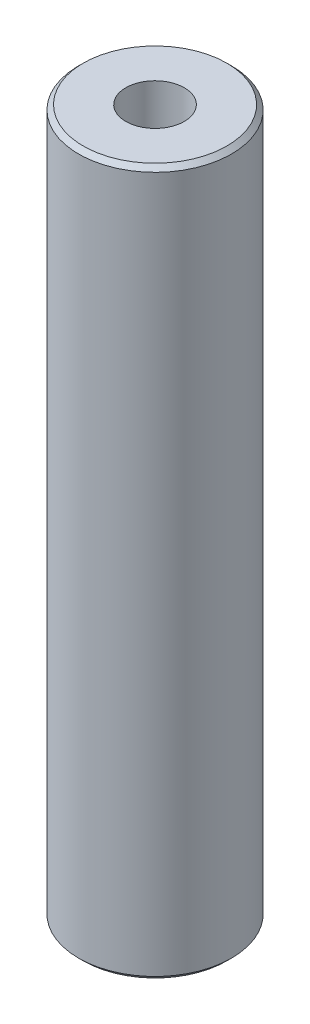
ISO-10303-21;
HEADER;
FILE_DESCRIPTION(('STEP AP214'),'2;1');
FILE_NAME('part.step','',(''),(''),'','','');
FILE_SCHEMA(('AUTOMOTIVE_DESIGN { 1 0 10303 214 1 1 1 1 }'));
ENDSEC;
DATA;
#1=APPLICATION_CONTEXT('core data for automotive mechanical design processes');
#2=APPLICATION_PROTOCOL_DEFINITION('international standard','automotive_design',2000,#1);
#3=PRODUCT_CONTEXT('',#1,'mechanical');
#4=PRODUCT('Part','Part','',(#3));
#5=PRODUCT_RELATED_PRODUCT_CATEGORY('part','',(#4));
#6=PRODUCT_DEFINITION_FORMATION('','',#4);
#7=PRODUCT_DEFINITION_CONTEXT('part definition',#1,'design');
#8=PRODUCT_DEFINITION('design','',#6,#7);
#9=PRODUCT_DEFINITION_SHAPE('','',#8);
#10=(LENGTH_UNIT() NAMED_UNIT(*) SI_UNIT(.MILLI.,.METRE.));
#11=(NAMED_UNIT(*) PLANE_ANGLE_UNIT() SI_UNIT($,.RADIAN.));
#12=(NAMED_UNIT(*) SI_UNIT($,.STERADIAN.) SOLID_ANGLE_UNIT());
#13=UNCERTAINTY_MEASURE_WITH_UNIT(LENGTH_MEASURE(1.E-05),#10,'distance_accuracy_value','');
#14=(GEOMETRIC_REPRESENTATION_CONTEXT(3) GLOBAL_UNCERTAINTY_ASSIGNED_CONTEXT((#13)) GLOBAL_UNIT_ASSIGNED_CONTEXT((#10,
#11,#12)) REPRESENTATION_CONTEXT('',''));
#15=CARTESIAN_POINT('',(0.,0.,0.));
#16=DIRECTION('',(0.,0.,1.));
#17=DIRECTION('',(1.,0.,0.));
#18=AXIS2_PLACEMENT_3D('',#15,#16,#17);
#19=CARTESIAN_POINT('',(0.,369.199846225601,0.));
#20=DIRECTION('',(0.,-1.,0.));
#21=DIRECTION('',(0.,0.,-1.));
#22=AXIS2_PLACEMENT_3D('',#19,#20,#21);
#23=CYLINDRICAL_SURFACE('',#22,40.);
#24=CARTESIAN_POINT('',(0.,366.779272620218,0.));
#25=DIRECTION('',(0.,1.,0.));
#26=DIRECTION('',(0.,0.,1.));
#27=AXIS2_PLACEMENT_3D('',#24,#25,#26);
#28=CIRCLE('',#27,40.);
#29=CARTESIAN_POINT('',(0.,366.779272620218,-40.));
#30=VERTEX_POINT('',#29);
#31=EDGE_CURVE('E50',#30,#30,#28,.F.);
#32=CARTESIAN_POINT('',(0.,2.42057360538284,0.));
#33=DIRECTION('',(0.,1.,0.));
#34=DIRECTION('',(0.,0.,1.));
#35=AXIS2_PLACEMENT_3D('',#32,#33,#34);
#36=CIRCLE('',#35,40.);
#37=CARTESIAN_POINT('',(0.,2.42057360538284,-40.));
#38=VERTEX_POINT('',#37);
#39=EDGE_CURVE('E51',#38,#38,#36,.T.);
#40=CARTESIAN_POINT('',(0.,366.779272620218,-40.));
#41=CARTESIAN_POINT('',(0.,362.98386950548,-40.));
#42=CARTESIAN_POINT('',(0.,359.188466390742,-40.));
#43=CARTESIAN_POINT('',(0.,351.597660161266,-40.));
#44=CARTESIAN_POINT('',(0.,347.802257046528,-40.));
#45=CARTESIAN_POINT('',(0.,340.211450817053,-40.));
#46=CARTESIAN_POINT('',(0.,336.416047702315,-40.));
#47=CARTESIAN_POINT('',(0.,328.825241472839,-40.));
#48=CARTESIAN_POINT('',(0.,325.029838358101,-40.));
#49=CARTESIAN_POINT('',(0.,317.439032128626,-40.));
#50=CARTESIAN_POINT('',(0.,313.643629013888,-40.));
#51=CARTESIAN_POINT('',(0.,306.052822784412,-40.));
#52=CARTESIAN_POINT('',(0.,302.257419669674,-40.));
#53=CARTESIAN_POINT('',(0.,294.666613440198,-40.));
#54=CARTESIAN_POINT('',(0.,290.87121032546,-40.));
#55=CARTESIAN_POINT('',(0.,283.280404095985,-40.));
#56=CARTESIAN_POINT('',(0.,279.485000981247,-40.));
#57=CARTESIAN_POINT('',(0.,271.894194751771,-40.));
#58=CARTESIAN_POINT('',(0.,268.098791637033,-40.));
#59=CARTESIAN_POINT('',(0.,260.507985407558,-40.));
#60=CARTESIAN_POINT('',(0.,256.71258229282,-40.));
#61=CARTESIAN_POINT('',(0.,249.121776063344,-40.));
#62=CARTESIAN_POINT('',(0.,245.326372948606,-40.));
#63=CARTESIAN_POINT('',(0.,237.73556671913,-40.));
#64=CARTESIAN_POINT('',(0.,233.940163604393,-40.));
#65=CARTESIAN_POINT('',(0.,226.349357374917,-40.));
#66=CARTESIAN_POINT('',(0.,222.553954260179,-40.));
#67=CARTESIAN_POINT('',(0.,214.963148030703,-40.));
#68=CARTESIAN_POINT('',(0.,211.167744915965,-40.));
#69=CARTESIAN_POINT('',(0.,203.57693868649,-40.));
#70=CARTESIAN_POINT('',(0.,199.781535571752,-40.));
#71=CARTESIAN_POINT('',(0.,192.190729342276,-40.));
#72=CARTESIAN_POINT('',(0.,188.395326227538,-40.));
#73=CARTESIAN_POINT('',(0.,180.804519998062,-40.));
#74=CARTESIAN_POINT('',(0.,177.009116883325,-40.));
#75=CARTESIAN_POINT('',(0.,169.418310653849,-40.));
#76=CARTESIAN_POINT('',(0.,165.622907539111,-40.));
#77=CARTESIAN_POINT('',(0.,158.032101309635,-40.));
#78=CARTESIAN_POINT('',(0.,154.236698194897,-40.));
#79=CARTESIAN_POINT('',(0.,146.645891965422,-40.));
#80=CARTESIAN_POINT('',(0.,142.850488850684,-40.));
#81=CARTESIAN_POINT('',(0.,135.259682621208,-40.));
#82=CARTESIAN_POINT('',(0.,131.46427950647,-40.));
#83=CARTESIAN_POINT('',(0.,123.873473276994,-40.));
#84=CARTESIAN_POINT('',(0.,120.078070162257,-40.));
#85=CARTESIAN_POINT('',(0.,112.487263932781,-40.));
#86=CARTESIAN_POINT('',(0.,108.691860818043,-40.));
#87=CARTESIAN_POINT('',(0.,101.101054588567,-40.));
#88=CARTESIAN_POINT('',(0.,97.3056514738295,-40.));
#89=CARTESIAN_POINT('',(0.,89.7148452443537,-40.));
#90=CARTESIAN_POINT('',(0.,85.9194421296158,-40.));
#91=CARTESIAN_POINT('',(0.,78.3286359001401,-40.));
#92=CARTESIAN_POINT('',(0.,74.5332327854022,-40.));
#93=CARTESIAN_POINT('',(0.,66.9424265559265,-40.));
#94=CARTESIAN_POINT('',(0.,63.1470234411887,-40.));
#95=CARTESIAN_POINT('',(0.,55.5562172117129,-40.));
#96=CARTESIAN_POINT('',(0.,51.760814096975,-40.));
#97=CARTESIAN_POINT('',(0.,44.1700078674993,-40.));
#98=CARTESIAN_POINT('',(0.,40.3746047527615,-40.));
#99=CARTESIAN_POINT('',(0.,32.7837985232858,-40.));
#100=CARTESIAN_POINT('',(0.,28.9883954085479,-40.));
#101=CARTESIAN_POINT('',(0.,21.3975891790721,-40.));
#102=CARTESIAN_POINT('',(0.,17.6021860643342,-40.));
#103=CARTESIAN_POINT('',(0.,10.0113798348585,-40.));
#104=CARTESIAN_POINT('',(0.,6.21597672012067,-40.));
#105=CARTESIAN_POINT('',(0.,2.42057360538284,-40.));
#106=B_SPLINE_CURVE_WITH_KNOTS('',3,(#40,#41,#42,#43,#44,#45,#46,#47,#48,#49,#50,#51,#52,#53,
#54,#55,#56,#57,#58,#59,#60,#61,#62,#63,#64,#65,#66,#67,#68,#69,#70,#71,#72,#73,#74,#75,#76,#77,
#78,#79,#80,#81,#82,#83,#84,#85,#86,#87,#88,#89,#90,#91,#92,#93,#94,#95,#96,#97,#98,#99,#100,
#101,#102,#103,#104,#105),.UNSPECIFIED.,.F.,.F.,(4,2,2,2,2,2,2,2,2,2,2,2,2,2,2,2,2,2,2,2,2,2,2,
2,2,2,2,2,2,2,2,2,4),(0.,11.3862093442136,22.7724186884272,34.1586280326408,45.5448373768544,
56.931046721068,68.3172560652816,79.7034654094952,91.0896747537088,102.475884097922,
113.862093442136,125.24830278635,136.634512130563,148.020721474777,159.40693081899,
170.793140163204,182.179349507418,193.565558851631,204.951768195845,216.337977540058,
227.724186884272,239.110396228485,250.496605572699,261.882814916913,273.269024261126,
284.65523360534,296.041442949553,307.427652293767,318.813861637981,330.200070982194,
341.586280326408,352.972489670621,364.358699014835),.UNSPECIFIED.);
#107=EDGE_CURVE('BSEAM39',#30,#38,#106,.T.);
#108=ORIENTED_EDGE('',*,*,#31,.T.);
#109=ORIENTED_EDGE('',*,*,#39,.T.);
#110=ORIENTED_EDGE('',*,*,#107,.T.);
#111=ORIENTED_EDGE('',*,*,#107,.F.);
#112=EDGE_LOOP('',(#108,#110,#109,#111));
#113=FACE_BOUND('',#112,.T.);
#114=ADVANCED_FACE('F39',(#113),#23,.T.);
#115=CARTESIAN_POINT('',(0.,369.199846225601,0.));
#116=DIRECTION('',(0.,1.,0.));
#117=DIRECTION('',(0.,0.,1.));
#118=AXIS2_PLACEMENT_3D('',#115,#116,#117);
#119=PLANE('',#118);
#120=CARTESIAN_POINT('',(0.,369.199846225601,0.));
#121=DIRECTION('',(0.,1.,0.));
#122=DIRECTION('',(0.,0.,1.));
#123=AXIS2_PLACEMENT_3D('',#120,#121,#122);
#124=CIRCLE('',#123,37.5794263946172);
#125=CARTESIAN_POINT('',(0.,369.199846225601,-37.5794263946172));
#126=VERTEX_POINT('',#125);
#127=EDGE_CURVE('E54',#126,#126,#124,.T.);
#128=ORIENTED_EDGE('',*,*,#127,.T.);
#129=EDGE_LOOP('',(#128));
#130=FACE_BOUND('',#129,.T.);
#131=CARTESIAN_POINT('',(0.,369.199846225601,0.));
#132=DIRECTION('',(0.,1.,0.));
#133=DIRECTION('',(0.,0.,1.));
#134=AXIS2_PLACEMENT_3D('',#131,#132,#133);
#135=CIRCLE('',#134,15.301985821967);
#136=CARTESIAN_POINT('',(0.,369.199846225601,15.301985821967));
#137=VERTEX_POINT('',#136);
#138=EDGE_CURVE('E58',#137,#137,#135,.T.);
#139=ORIENTED_EDGE('',*,*,#138,.F.);
#140=EDGE_LOOP('',(#139));
#141=FACE_BOUND('',#140,.T.);
#142=ADVANCED_FACE('F69',(#130,#141),#119,.T.);
#143=CARTESIAN_POINT('',(0.,0.,0.));
#144=DIRECTION('',(0.,1.,0.));
#145=DIRECTION('',(0.,0.,1.));
#146=AXIS2_PLACEMENT_3D('',#143,#144,#145);
#147=PLANE('',#146);
#148=CARTESIAN_POINT('',(0.,0.,0.));
#149=DIRECTION('',(0.,1.,0.));
#150=DIRECTION('',(0.,0.,1.));
#151=AXIS2_PLACEMENT_3D('',#148,#149,#150);
#152=CIRCLE('',#151,37.5794263946172);
#153=CARTESIAN_POINT('',(0.,0.,37.5794263946172));
#154=VERTEX_POINT('',#153);
#155=EDGE_CURVE('E10',#154,#154,#152,.F.);
#156=ORIENTED_EDGE('',*,*,#155,.T.);
#157=EDGE_LOOP('',(#156));
#158=FACE_BOUND('',#157,.T.);
#159=CARTESIAN_POINT('',(0.,0.,0.));
#160=DIRECTION('',(0.,1.,0.));
#161=DIRECTION('',(0.,0.,1.));
#162=AXIS2_PLACEMENT_3D('',#159,#160,#161);
#163=CIRCLE('',#162,15.301985821967);
#164=CARTESIAN_POINT('',(0.,0.,15.301985821967));
#165=VERTEX_POINT('',#164);
#166=EDGE_CURVE('E63',#165,#165,#163,.T.);
#167=ORIENTED_EDGE('',*,*,#166,.T.);
#168=EDGE_LOOP('',(#167));
#169=FACE_BOUND('',#168,.T.);
#170=ADVANCED_FACE('F75',(#158,#169),#147,.F.);
#171=CARTESIAN_POINT('',(0.,369.199846225601,0.));
#172=DIRECTION('',(0.,-1.,0.));
#173=DIRECTION('',(0.,0.,-1.));
#174=AXIS2_PLACEMENT_3D('',#171,#172,#173);
#175=CYLINDRICAL_SURFACE('',#174,15.301985821967);
#176=ORIENTED_EDGE('',*,*,#138,.T.);
#177=EDGE_LOOP('',(#176));
#178=FACE_BOUND('',#177,.T.);
#179=ORIENTED_EDGE('',*,*,#166,.F.);
#180=EDGE_LOOP('',(#179));
#181=FACE_BOUND('',#180,.T.);
#182=ADVANCED_FACE('F70',(#178,#181),#175,.F.);
#183=CARTESIAN_POINT('',(0.,369.199846225601,0.));
#184=DIRECTION('',(0.,-1.,0.));
#185=DIRECTION('',(0.,0.,-1.));
#186=AXIS2_PLACEMENT_3D('',#183,#184,#185);
#187=CONICAL_SURFACE('',#186,37.5794263946172,0.785398163397441);
#188=CARTESIAN_POINT('',(0.,366.779272620218,-40.));
#189=CARTESIAN_POINT('',(0.,366.804486928607,-39.9747856916106));
#190=CARTESIAN_POINT('',(0.,366.829701236997,-39.9495713832212));
#191=CARTESIAN_POINT('',(0.,366.880129853775,-39.8991427664424));
#192=CARTESIAN_POINT('',(0.,366.905344162165,-39.873928458053));
#193=CARTESIAN_POINT('',(0.,366.955772778944,-39.8234998412742));
#194=CARTESIAN_POINT('',(0.,366.980987087333,-39.7982855328848));
#195=CARTESIAN_POINT('',(0.,367.031415704112,-39.747856916106));
#196=CARTESIAN_POINT('',(0.,367.056630012501,-39.7226426077166));
#197=CARTESIAN_POINT('',(0.,367.10705862928,-39.6722139909378));
#198=CARTESIAN_POINT('',(0.,367.132272937669,-39.6469996825484));
#199=CARTESIAN_POINT('',(0.,367.182701554448,-39.5965710657696));
#200=CARTESIAN_POINT('',(0.,367.207915862838,-39.5713567573802));
#201=CARTESIAN_POINT('',(0.,367.258344479616,-39.5209281406013));
#202=CARTESIAN_POINT('',(0.,367.283558788006,-39.4957138322119));
#203=CARTESIAN_POINT('',(0.,367.333987404785,-39.4452852154331));
#204=CARTESIAN_POINT('',(0.,367.359201713174,-39.4200709070437));
#205=CARTESIAN_POINT('',(0.,367.409630329953,-39.3696422902649));
#206=CARTESIAN_POINT('',(0.,367.434844638342,-39.3444279818755));
#207=CARTESIAN_POINT('',(0.,367.485273255121,-39.2939993650967));
#208=CARTESIAN_POINT('',(0.,367.510487563511,-39.2687850567073));
#209=CARTESIAN_POINT('',(0.,367.560916180289,-39.2183564399285));
#210=CARTESIAN_POINT('',(0.,367.586130488679,-39.1931421315391));
#211=CARTESIAN_POINT('',(0.,367.636559105458,-39.1427135147603));
#212=CARTESIAN_POINT('',(0.,367.661773413847,-39.1174992063709));
#213=CARTESIAN_POINT('',(0.,367.712202030626,-39.0670705895921));
#214=CARTESIAN_POINT('',(0.,367.737416339015,-39.0418562812027));
#215=CARTESIAN_POINT('',(0.,367.787844955794,-38.9914276644239));
#216=CARTESIAN_POINT('',(0.,367.813059264183,-38.9662133560345));
#217=CARTESIAN_POINT('',(0.,367.863487880962,-38.9157847392556));
#218=CARTESIAN_POINT('',(0.,367.888702189352,-38.8905704308662));
#219=CARTESIAN_POINT('',(0.,367.93913080613,-38.8401418140874));
#220=CARTESIAN_POINT('',(0.,367.96434511452,-38.814927505698));
#221=CARTESIAN_POINT('',(0.,368.014773731299,-38.7644988889192));
#222=CARTESIAN_POINT('',(0.,368.039988039688,-38.7392845805298));
#223=CARTESIAN_POINT('',(0.,368.090416656467,-38.688855963751));
#224=CARTESIAN_POINT('',(0.,368.115630964856,-38.6636416553616));
#225=CARTESIAN_POINT('',(0.,368.166059581635,-38.6132130385828));
#226=CARTESIAN_POINT('',(0.,368.191273890024,-38.5879987301934));
#227=CARTESIAN_POINT('',(0.,368.241702506803,-38.5375701134146));
#228=CARTESIAN_POINT('',(0.,368.266916815193,-38.5123558050252));
#229=CARTESIAN_POINT('',(0.,368.317345431971,-38.4619271882464));
#230=CARTESIAN_POINT('',(0.,368.342559740361,-38.436712879857));
#231=CARTESIAN_POINT('',(0.,368.39298835714,-38.3862842630782));
#232=CARTESIAN_POINT('',(0.,368.418202665529,-38.3610699546888));
#233=CARTESIAN_POINT('',(0.,368.468631282308,-38.3106413379099));
#234=CARTESIAN_POINT('',(0.,368.493845590697,-38.2854270295205));
#235=CARTESIAN_POINT('',(0.,368.544274207476,-38.2349984127417));
#236=CARTESIAN_POINT('',(0.,368.569488515865,-38.2097841043523));
#237=CARTESIAN_POINT('',(0.,368.619917132644,-38.1593554875735));
#238=CARTESIAN_POINT('',(0.,368.645131441034,-38.1341411791841));
#239=CARTESIAN_POINT('',(0.,368.695560057813,-38.0837125624053));
#240=CARTESIAN_POINT('',(0.,368.720774366202,-38.0584982540159));
#241=CARTESIAN_POINT('',(0.,368.771202982981,-38.0080696372371));
#242=CARTESIAN_POINT('',(0.,368.79641729137,-37.9828553288477));
#243=CARTESIAN_POINT('',(0.,368.846845908149,-37.9324267120689));
#244=CARTESIAN_POINT('',(0.,368.872060216538,-37.9072124036795));
#245=CARTESIAN_POINT('',(0.,368.922488833317,-37.8567837869007));
#246=CARTESIAN_POINT('',(0.,368.947703141707,-37.8315694785113));
#247=CARTESIAN_POINT('',(0.,368.998131758485,-37.7811408617325));
#248=CARTESIAN_POINT('',(0.,369.023346066875,-37.7559265533431));
#249=CARTESIAN_POINT('',(0.,369.073774683654,-37.7054979365642));
#250=CARTESIAN_POINT('',(0.,369.098988992043,-37.6802836281748));
#251=CARTESIAN_POINT('',(0.,369.149417608822,-37.629855011396));
#252=CARTESIAN_POINT('',(0.,369.174631917211,-37.6046407030066));
#253=CARTESIAN_POINT('',(0.,369.199846225601,-37.5794263946172));
#254=B_SPLINE_CURVE_WITH_KNOTS('',3,(#188,#189,#190,#191,#192,#193,#194,#195,#196,#197,#198,
#199,#200,#201,#202,#203,#204,#205,#206,#207,#208,#209,#210,#211,#212,#213,#214,#215,#216,#217,
#218,#219,#220,#221,#222,#223,#224,#225,#226,#227,#228,#229,#230,#231,#232,#233,#234,#235,#236,
#237,#238,#239,#240,#241,#242,#243,#244,#245,#246,#247,#248,#249,#250,#251,#252,#253),
.UNSPECIFIED.,.F.,.F.,(4,2,2,2,2,2,2,2,2,2,2,2,2,2,2,2,2,2,2,2,2,2,2,2,2,2,2,2,2,2,2,2,4),(0.,
0.106975250670495,0.213950501340951,0.320925752011402,0.427901002681858,0.534876253352314,
0.64185150402277,0.748826754693226,0.855802005363682,0.962777256034172,1.06975250670463,
1.17672775737508,1.28370300804554,1.390678258716,1.49765350938645,1.60462876005691,
1.71160401072736,1.81857926139785,1.92555451206831,2.03252976273877,2.13950501340922,
2.24648026407968,2.35345551475013,2.46043076542058,2.56740601609104,2.67438126676154,
2.78135651743199,2.88833176810245,2.9953070187729,3.10228226944335,3.20925752011381,
3.31623277078427,3.42320802145476),.UNSPECIFIED.);
#255=EDGE_CURVE('BSEAM81',#30,#126,#254,.T.);
#256=ORIENTED_EDGE('',*,*,#31,.F.);
#257=ORIENTED_EDGE('',*,*,#127,.F.);
#258=ORIENTED_EDGE('',*,*,#255,.T.);
#259=ORIENTED_EDGE('',*,*,#255,.F.);
#260=EDGE_LOOP('',(#256,#258,#257,#259));
#261=FACE_BOUND('',#260,.T.);
#262=ADVANCED_FACE('F81',(#261),#187,.T.);
#263=CARTESIAN_POINT('',(0.,2.42057360538284,0.));
#264=DIRECTION('',(0.,1.,0.));
#265=DIRECTION('',(0.,0.,1.));
#266=AXIS2_PLACEMENT_3D('',#263,#264,#265);
#267=CONICAL_SURFACE('',#266,40.,0.785398163397447);
#268=ORIENTED_EDGE('',*,*,#155,.F.);
#269=EDGE_LOOP('',(#268));
#270=FACE_BOUND('',#269,.T.);
#271=ORIENTED_EDGE('',*,*,#39,.F.);
#272=EDGE_LOOP('',(#271));
#273=FACE_BOUND('',#272,.T.);
#274=ADVANCED_FACE('F45',(#270,#273),#267,.T.);
#275=CLOSED_SHELL('',(#114,#142,#170,#182,#262,#274));
#276=MANIFOLD_SOLID_BREP('B2',#275);
#277=ADVANCED_BREP_SHAPE_REPRESENTATION('',(#18,#276),#14);
#278=SHAPE_DEFINITION_REPRESENTATION(#9,#277);
ENDSEC;
END-ISO-10303-21;
